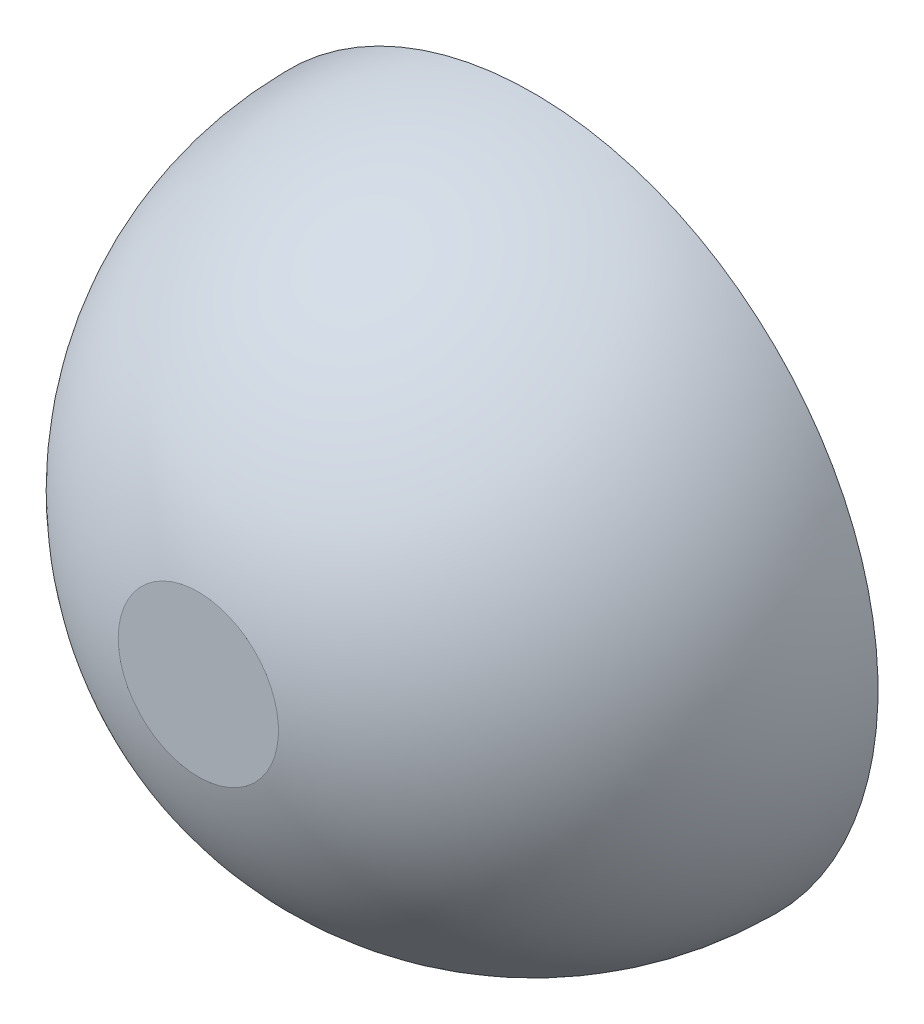
ISO-10303-21;
HEADER;
FILE_DESCRIPTION(('STEP AP214'),'2;1');
FILE_NAME('part.step','',(''),(''),'','','');
FILE_SCHEMA(('AUTOMOTIVE_DESIGN { 1 0 10303 214 1 1 1 1 }'));
ENDSEC;
DATA;
#1=APPLICATION_CONTEXT('core data for automotive mechanical design processes');
#2=APPLICATION_PROTOCOL_DEFINITION('international standard','automotive_design',2000,#1);
#3=PRODUCT_CONTEXT('',#1,'mechanical');
#4=PRODUCT('Part','Part','',(#3));
#5=PRODUCT_RELATED_PRODUCT_CATEGORY('part','',(#4));
#6=PRODUCT_DEFINITION_FORMATION('','',#4);
#7=PRODUCT_DEFINITION_CONTEXT('part definition',#1,'design');
#8=PRODUCT_DEFINITION('design','',#6,#7);
#9=PRODUCT_DEFINITION_SHAPE('','',#8);
#10=(LENGTH_UNIT() NAMED_UNIT(*) SI_UNIT(.MILLI.,.METRE.));
#11=(NAMED_UNIT(*) PLANE_ANGLE_UNIT() SI_UNIT($,.RADIAN.));
#12=(NAMED_UNIT(*) SI_UNIT($,.STERADIAN.) SOLID_ANGLE_UNIT());
#13=UNCERTAINTY_MEASURE_WITH_UNIT(LENGTH_MEASURE(1.E-05),#10,'distance_accuracy_value','');
#14=(GEOMETRIC_REPRESENTATION_CONTEXT(3) GLOBAL_UNCERTAINTY_ASSIGNED_CONTEXT((#13)) GLOBAL_UNIT_ASSIGNED_CONTEXT((#10,
#11,#12)) REPRESENTATION_CONTEXT('',''));
#15=CARTESIAN_POINT('',(0.,0.,0.));
#16=DIRECTION('',(0.,0.,1.));
#17=DIRECTION('',(1.,0.,0.));
#18=AXIS2_PLACEMENT_3D('',#15,#16,#17);
#19=CARTESIAN_POINT('',(0.,0.,400.));
#20=DIRECTION('',(0.,0.,-1.));
#21=DIRECTION('',(-1.,0.,0.));
#22=AXIS2_PLACEMENT_3D('',#19,#20,#21);
#23=SPHERICAL_SURFACE('',#22,56.5);
#24=CARTESIAN_POINT('',(0.,0.,454.952018393104));
#25=DIRECTION('',(0.,0.,-1.));
#26=DIRECTION('',(-1.,0.,0.));
#27=AXIS2_PLACEMENT_3D('',#24,#25,#26);
#28=CIRCLE('',#27,13.1349029126214);
#29=CARTESIAN_POINT('',(-13.1349029126214,0.,454.952018393104));
#30=VERTEX_POINT('',#29);
#31=EDGE_CURVE('E60',#30,#30,#28,.T.);
#32=ORIENTED_EDGE('',*,*,#31,.T.);
#33=EDGE_LOOP('',(#32));
#34=FACE_BOUND('',#33,.T.);
#35=CARTESIAN_POINT('',(0.,0.,400.));
#36=DIRECTION('',(0.,0.,-1.));
#37=DIRECTION('',(-1.,0.,0.));
#38=AXIS2_PLACEMENT_3D('',#35,#36,#37);
#39=CIRCLE('',#38,56.5);
#40=CARTESIAN_POINT('',(-56.5,0.,400.));
#41=VERTEX_POINT('',#40);
#42=EDGE_CURVE('E56',#41,#41,#39,.T.);
#43=ORIENTED_EDGE('',*,*,#42,.F.);
#44=EDGE_LOOP('',(#43));
#45=FACE_BOUND('',#44,.T.);
#46=ADVANCED_FACE('F45',(#34,#45),#23,.T.);
#47=CARTESIAN_POINT('',(0.,0.,449.796830476206));
#48=DIRECTION('',(0.,0.,1.));
#49=DIRECTION('',(1.,0.,0.));
#50=AXIS2_PLACEMENT_3D('',#47,#48,#49);
#51=PLANE('',#50);
#52=CARTESIAN_POINT('',(0.,0.,449.796830476206));
#53=DIRECTION('',(0.,0.,-1.));
#54=DIRECTION('',(-1.,0.,0.));
#55=AXIS2_PLACEMENT_3D('',#52,#53,#54);
#56=CIRCLE('',#55,13.1349029126214);
#57=CARTESIAN_POINT('',(-13.1349029126214,0.,449.796830476206));
#58=VERTEX_POINT('',#57);
#59=EDGE_CURVE('E10',#58,#58,#56,.T.);
#60=ORIENTED_EDGE('',*,*,#59,.T.);
#61=EDGE_LOOP('',(#60));
#62=FACE_BOUND('',#61,.T.);
#63=ADVANCED_FACE('F77',(#62),#51,.F.);
#64=CARTESIAN_POINT('',(0.,0.,400.));
#65=DIRECTION('',(0.,0.,-1.));
#66=DIRECTION('',(-1.,0.,0.));
#67=AXIS2_PLACEMENT_3D('',#64,#65,#66);
#68=SPHERICAL_SURFACE('',#67,51.5);
#69=ORIENTED_EDGE('',*,*,#59,.F.);
#70=EDGE_LOOP('',(#69));
#71=FACE_BOUND('',#70,.T.);
#72=CARTESIAN_POINT('',(0.,0.,400.));
#73=DIRECTION('',(0.,0.,-1.));
#74=DIRECTION('',(-1.,0.,0.));
#75=AXIS2_PLACEMENT_3D('',#72,#73,#74);
#76=CIRCLE('',#75,51.5);
#77=CARTESIAN_POINT('',(-51.5,0.,400.));
#78=VERTEX_POINT('',#77);
#79=EDGE_CURVE('E52',#78,#78,#76,.T.);
#80=ORIENTED_EDGE('',*,*,#79,.T.);
#81=EDGE_LOOP('',(#80));
#82=FACE_BOUND('',#81,.T.);
#83=ADVANCED_FACE('F73',(#71,#82),#68,.F.);
#84=CARTESIAN_POINT('',(0.,0.,400.));
#85=DIRECTION('',(0.,0.,1.));
#86=DIRECTION('',(1.,0.,0.));
#87=AXIS2_PLACEMENT_3D('',#84,#85,#86);
#88=PLANE('',#87);
#89=ORIENTED_EDGE('',*,*,#79,.F.);
#90=EDGE_LOOP('',(#89));
#91=FACE_BOUND('',#90,.T.);
#92=ORIENTED_EDGE('',*,*,#42,.T.);
#93=EDGE_LOOP('',(#92));
#94=FACE_BOUND('',#93,.T.);
#95=ADVANCED_FACE('F69',(#91,#94),#88,.F.);
#96=CARTESIAN_POINT('',(0.,0.,454.952018393104));
#97=DIRECTION('',(0.,0.,-1.));
#98=DIRECTION('',(-1.,0.,0.));
#99=AXIS2_PLACEMENT_3D('',#96,#97,#98);
#100=PLANE('',#99);
#101=ORIENTED_EDGE('',*,*,#31,.F.);
#102=EDGE_LOOP('',(#101));
#103=FACE_BOUND('',#102,.T.);
#104=ADVANCED_FACE('F47',(#103),#100,.F.);
#105=CLOSED_SHELL('',(#46,#63,#83,#95,#104));
#106=MANIFOLD_SOLID_BREP('B2',#105);
#107=ADVANCED_BREP_SHAPE_REPRESENTATION('',(#18,#106),#14);
#108=SHAPE_DEFINITION_REPRESENTATION(#9,#107);
ENDSEC;
END-ISO-10303-21;
